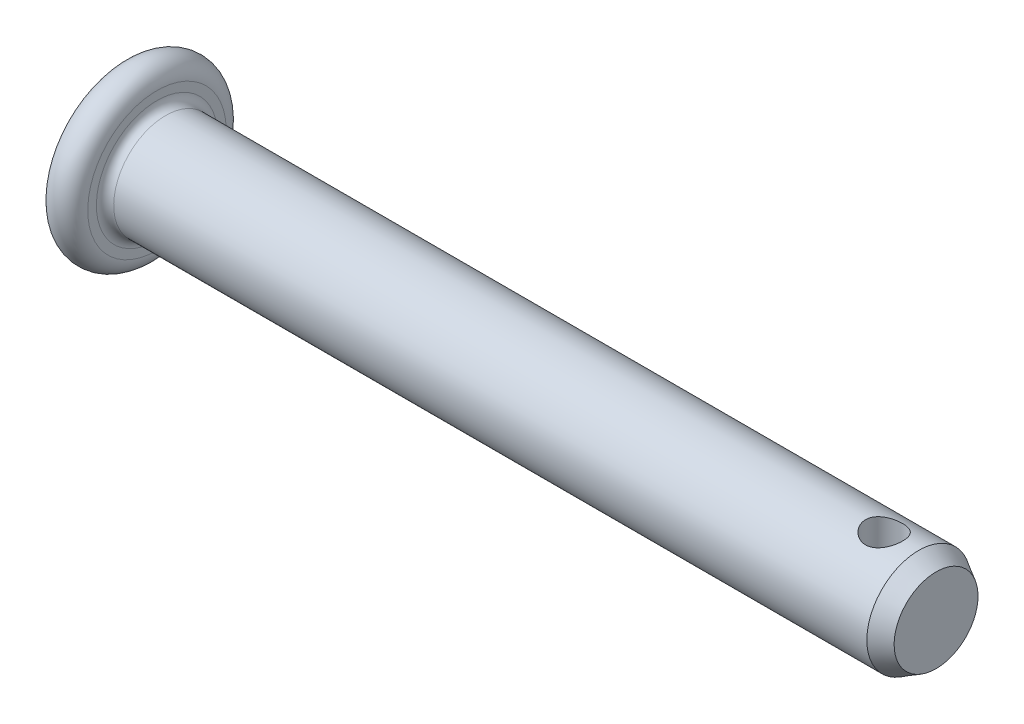
ISO-10303-21;
HEADER;
FILE_DESCRIPTION(('STEP AP214'),'2;1');
FILE_NAME('part.step','',(''),(''),'','','');
FILE_SCHEMA(('AUTOMOTIVE_DESIGN { 1 0 10303 214 1 1 1 1 }'));
ENDSEC;
DATA;
#1=APPLICATION_CONTEXT('core data for automotive mechanical design processes');
#2=APPLICATION_PROTOCOL_DEFINITION('international standard','automotive_design',2000,#1);
#3=PRODUCT_CONTEXT('',#1,'mechanical');
#4=PRODUCT('Part','Part','',(#3));
#5=PRODUCT_RELATED_PRODUCT_CATEGORY('part','',(#4));
#6=PRODUCT_DEFINITION_FORMATION('','',#4);
#7=PRODUCT_DEFINITION_CONTEXT('part definition',#1,'design');
#8=PRODUCT_DEFINITION('design','',#6,#7);
#9=PRODUCT_DEFINITION_SHAPE('','',#8);
#10=(LENGTH_UNIT() NAMED_UNIT(*) SI_UNIT(.MILLI.,.METRE.));
#11=(NAMED_UNIT(*) PLANE_ANGLE_UNIT() SI_UNIT($,.RADIAN.));
#12=(NAMED_UNIT(*) SI_UNIT($,.STERADIAN.) SOLID_ANGLE_UNIT());
#13=UNCERTAINTY_MEASURE_WITH_UNIT(LENGTH_MEASURE(1.E-05),#10,'distance_accuracy_value','');
#14=(GEOMETRIC_REPRESENTATION_CONTEXT(3) GLOBAL_UNCERTAINTY_ASSIGNED_CONTEXT((#13)) GLOBAL_UNIT_ASSIGNED_CONTEXT((#10,
#11,#12)) REPRESENTATION_CONTEXT('',''));
#15=CARTESIAN_POINT('',(0.,0.,0.));
#16=DIRECTION('',(0.,0.,1.));
#17=DIRECTION('',(1.,0.,0.));
#18=AXIS2_PLACEMENT_3D('',#15,#16,#17);
#19=CARTESIAN_POINT('',(47.,0.,0.));
#20=DIRECTION('',(-1.,0.,0.));
#21=DIRECTION('',(0.,-1.,0.));
#22=AXIS2_PLACEMENT_3D('',#19,#20,#21);
#23=PLANE('',#22);
#24=CARTESIAN_POINT('',(47.,0.,0.));
#25=DIRECTION('',(-1.,0.,0.));
#26=DIRECTION('',(0.,-1.,0.));
#27=AXIS2_PLACEMENT_3D('',#24,#25,#26);
#28=CIRCLE('',#27,2.42264973081038);
#29=CARTESIAN_POINT('',(47.,-2.42264973081038,0.));
#30=VERTEX_POINT('',#29);
#31=EDGE_CURVE('E107',#30,#30,#28,.T.);
#32=ORIENTED_EDGE('',*,*,#31,.F.);
#33=EDGE_LOOP('',(#32));
#34=FACE_BOUND('',#33,.T.);
#35=ADVANCED_FACE('F33',(#34),#23,.F.);
#36=CARTESIAN_POINT('',(0.,0.,0.));
#37=DIRECTION('',(1.,0.,0.));
#38=DIRECTION('',(0.,1.,0.));
#39=AXIS2_PLACEMENT_3D('',#36,#37,#38);
#40=PLANE('',#39);
#41=CARTESIAN_POINT('',(0.,0.,0.));
#42=DIRECTION('',(-1.,0.,0.));
#43=DIRECTION('',(0.,-1.,0.));
#44=AXIS2_PLACEMENT_3D('',#41,#42,#43);
#45=CIRCLE('',#44,4.);
#46=CARTESIAN_POINT('',(0.,-4.,0.));
#47=VERTEX_POINT('',#46);
#48=EDGE_CURVE('E51',#47,#47,#45,.T.);
#49=ORIENTED_EDGE('',*,*,#48,.T.);
#50=EDGE_LOOP('',(#49));
#51=FACE_BOUND('',#50,.T.);
#52=ADVANCED_FACE('F81',(#51),#40,.F.);
#53=CARTESIAN_POINT('',(1.,0.,0.));
#54=DIRECTION('',(-1.,0.,0.));
#55=DIRECTION('',(0.,-1.,0.));
#56=AXIS2_PLACEMENT_3D('',#53,#54,#55);
#57=TOROIDAL_SURFACE('',#56,4.,1.);
#58=ORIENTED_EDGE('',*,*,#48,.F.);
#59=EDGE_LOOP('',(#58));
#60=FACE_BOUND('',#59,.T.);
#61=CARTESIAN_POINT('',(2.,0.,0.));
#62=DIRECTION('',(-1.,0.,0.));
#63=DIRECTION('',(0.,-1.,0.));
#64=AXIS2_PLACEMENT_3D('',#61,#62,#63);
#65=CIRCLE('',#64,4.);
#66=CARTESIAN_POINT('',(2.,-4.,0.));
#67=VERTEX_POINT('',#66);
#68=EDGE_CURVE('E101',#67,#67,#65,.T.);
#69=ORIENTED_EDGE('',*,*,#68,.T.);
#70=EDGE_LOOP('',(#69));
#71=FACE_BOUND('',#70,.T.);
#72=ADVANCED_FACE('F86',(#60,#71),#57,.T.);
#73=CARTESIAN_POINT('',(2.,3.,0.));
#74=DIRECTION('',(-1.,0.,0.));
#75=DIRECTION('',(0.,-1.,0.));
#76=AXIS2_PLACEMENT_3D('',#73,#74,#75);
#77=PLANE('',#76);
#78=CARTESIAN_POINT('',(2.,0.,0.));
#79=DIRECTION('',(-1.,0.,0.));
#80=DIRECTION('',(0.,-1.,0.));
#81=AXIS2_PLACEMENT_3D('',#78,#79,#80);
#82=CIRCLE('',#81,3.5);
#83=CARTESIAN_POINT('',(2.,-3.5,0.));
#84=VERTEX_POINT('',#83);
#85=EDGE_CURVE('E46',#84,#84,#82,.T.);
#86=ORIENTED_EDGE('',*,*,#85,.T.);
#87=EDGE_LOOP('',(#86));
#88=FACE_BOUND('',#87,.T.);
#89=ORIENTED_EDGE('',*,*,#68,.F.);
#90=EDGE_LOOP('',(#89));
#91=FACE_BOUND('',#90,.T.);
#92=ADVANCED_FACE('F76',(#88,#91),#77,.F.);
#93=CARTESIAN_POINT('',(-19.830028721469,0.,0.));
#94=DIRECTION('',(-1.,0.,0.));
#95=DIRECTION('',(0.,-1.,0.));
#96=AXIS2_PLACEMENT_3D('',#93,#94,#95);
#97=CYLINDRICAL_SURFACE('',#96,3.);
#98=CARTESIAN_POINT('',(45.07,-3.,0.));
#99=CARTESIAN_POINT('',(45.0700011876972,-3.00000085236087,-0.0581444236668719));
#100=CARTESIAN_POINT('',(45.0652454821601,-2.99829449507259,-0.116280392908705));
#101=CARTESIAN_POINT('',(45.0464167005906,-2.99165685483232,-0.230825968284265));
#102=CARTESIAN_POINT('',(45.0323439537525,-2.98672568582106,-0.28723563533889));
#103=CARTESIAN_POINT('',(44.9954346036702,-2.97417071234846,-0.396660648282025));
#104=CARTESIAN_POINT('',(44.9726138998507,-2.9665517948651,-0.449681949737068));
#105=CARTESIAN_POINT('',(44.9189332388162,-2.94938858506761,-0.551142422044951));
#106=CARTESIAN_POINT('',(44.8880713620351,-2.93984383314657,-0.599580495033598));
#107=CARTESIAN_POINT('',(44.8179248823826,-2.9194071403264,-0.692387327079883));
#108=CARTESIAN_POINT('',(44.7783824473048,-2.90847964888086,-0.736553318241224));
#109=CARTESIAN_POINT('',(44.6925449030632,-2.88669310706967,-0.817786647986673));
#110=CARTESIAN_POINT('',(44.6462480088811,-2.87583407558994,-0.854852104086169));
#111=CARTESIAN_POINT('',(44.5463055685407,-2.85501068982919,-0.922060907926826));
#112=CARTESIAN_POINT('',(44.4924646657491,-2.84508892880968,-0.951928247953222));
#113=CARTESIAN_POINT('',(44.380113472799,-2.82781091224008,-1.00209513842957));
#114=CARTESIAN_POINT('',(44.3216048547123,-2.8204537430262,-1.02239809720235));
#115=CARTESIAN_POINT('',(44.2039019833382,-2.80951535958268,-1.0520772757923));
#116=CARTESIAN_POINT('',(44.1448172357284,-2.80580193327061,-1.06183749683206));
#117=CARTESIAN_POINT('',(44.0257409145972,-2.8021825601748,-1.07135492754196));
#118=CARTESIAN_POINT('',(43.9657496791047,-2.80227522749661,-1.0711157782338));
#119=CARTESIAN_POINT('',(43.8499646708127,-2.80614272311333,-1.06093690056902));
#120=CARTESIAN_POINT('',(43.7941176270585,-2.80972098646963,-1.05151500443465));
#121=CARTESIAN_POINT('',(43.684856523547,-2.81983209908789,-1.02408901959715));
#122=CARTESIAN_POINT('',(43.631442796367,-2.82636535090163,-1.00608376158292));
#123=CARTESIAN_POINT('',(43.5274547890558,-2.84177828691616,-0.961693602686381));
#124=CARTESIAN_POINT('',(43.4769475973174,-2.85069749916812,-0.935165865592745));
#125=CARTESIAN_POINT('',(43.3809452449066,-2.86986267945419,-0.874583078748186));
#126=CARTESIAN_POINT('',(43.3354516997628,-2.8801090728408,-0.840525613286241));
#127=CARTESIAN_POINT('',(43.2478812607032,-2.90152902086688,-0.763427644942957));
#128=CARTESIAN_POINT('',(43.206176106455,-2.91272121621961,-0.719969138346395));
#129=CARTESIAN_POINT('',(43.1305412101273,-2.93423605096064,-0.626541431645342));
#130=CARTESIAN_POINT('',(43.096612445826,-2.94455858089692,-0.576571414042076));
#131=CARTESIAN_POINT('',(43.037134911732,-2.96334280106686,-0.470663813489915));
#132=CARTESIAN_POINT('',(43.0116989156008,-2.97177899260399,-0.41465805771301));
#133=CARTESIAN_POINT('',(42.9707295339136,-2.98565291760969,-0.298787834826479));
#134=CARTESIAN_POINT('',(42.9551921867146,-2.99109185052508,-0.238924922006458));
#135=CARTESIAN_POINT('',(42.9351502569951,-2.99815307150106,-0.120176713024237));
#136=CARTESIAN_POINT('',(42.9301443365055,-2.99994863872938,-0.0613862385932611));
#137=CARTESIAN_POINT('',(42.9298619122213,-3.0000491325843,0.0562146696396688));
#138=CARTESIAN_POINT('',(42.9345834909011,-2.99835474716508,0.115025097223483));
#139=CARTESIAN_POINT('',(42.9532334090568,-2.99178024275448,0.228902798115541));
#140=CARTESIAN_POINT('',(42.966842749204,-2.9870105745618,0.284029339909902));
#141=CARTESIAN_POINT('',(43.0024714986183,-2.97487542105585,0.391185719351828));
#142=CARTESIAN_POINT('',(43.0244919996437,-2.96750959877458,0.443215153984975));
#143=CARTESIAN_POINT('',(43.0769982314489,-2.95066063760259,0.544338996176854));
#144=CARTESIAN_POINT('',(43.107704982926,-2.94112369208754,0.593309412151399));
#145=CARTESIAN_POINT('',(43.1764581116928,-2.92100017959612,0.685558726346786));
#146=CARTESIAN_POINT('',(43.2145070016372,-2.91041325389611,0.72883566757353));
#147=CARTESIAN_POINT('',(43.2992134462063,-2.88867484913537,0.810833788817092));
#148=CARTESIAN_POINT('',(43.3462173600148,-2.87752282581952,0.849197933366988));
#149=CARTESIAN_POINT('',(43.4462261994023,-2.85646292212537,0.917552598759176));
#150=CARTESIAN_POINT('',(43.4992314120457,-2.84655510130972,0.947542718802958));
#151=CARTESIAN_POINT('',(43.6099668619782,-2.8291763691011,0.998240487223736));
#152=CARTESIAN_POINT('',(43.6677017385475,-2.82170788711416,1.01893888935077));
#153=CARTESIAN_POINT('',(43.7861729264571,-2.81022365284711,1.05020274987965));
#154=CARTESIAN_POINT('',(43.8469075987407,-2.80620603664474,1.06077367880805));
#155=CARTESIAN_POINT('',(43.9658279695292,-2.80231029733869,1.07102011644591));
#156=CARTESIAN_POINT('',(44.0239548678002,-2.80220371006762,1.07129697066714));
#157=CARTESIAN_POINT('',(44.1393796330133,-2.80556573590001,1.0624607102674));
#158=CARTESIAN_POINT('',(44.1966775637668,-2.80903407231596,1.05334832234342));
#159=CARTESIAN_POINT('',(44.3073786660326,-2.81897366332907,1.02644235659171));
#160=CARTESIAN_POINT('',(44.3608433391118,-2.82536785008475,1.00887100662083));
#161=CARTESIAN_POINT('',(44.4641022604647,-2.84040087461525,0.96573395605646));
#162=CARTESIAN_POINT('',(44.5138956232391,-2.84904025165859,0.94016633455127));
#163=CARTESIAN_POINT('',(44.6110273518143,-2.86811343709818,0.880315920251174));
#164=CARTESIAN_POINT('',(44.658128580184,-2.8786140770729,0.845669776577044));
#165=CARTESIAN_POINT('',(44.7460418476776,-2.89997524804009,0.769231276304803));
#166=CARTESIAN_POINT('',(44.7868519805052,-2.91083588691111,0.727436761704251));
#167=CARTESIAN_POINT('',(44.8629720193145,-2.93230677789537,0.635533564492521));
#168=CARTESIAN_POINT('',(44.8979330046734,-2.94288123522134,0.585126317810479));
#169=CARTESIAN_POINT('',(44.9588615768249,-2.96203926538264,0.478788097154092));
#170=CARTESIAN_POINT('',(44.9848298787494,-2.97062299651003,0.422857562867087));
#171=CARTESIAN_POINT('',(45.0269245871362,-2.98484138608738,0.306830038272942));
#172=CARTESIAN_POINT('',(45.0430193844933,-2.99046656489376,0.246720345464761));
#173=CARTESIAN_POINT('',(45.0645543914337,-2.99804470450523,0.124403328906361));
#174=CARTESIAN_POINT('',(45.0699987295257,-2.99999908823344,0.0621968274718898));
#175=CARTESIAN_POINT('',(45.07,-3.,0.));
#176=B_SPLINE_CURVE_WITH_KNOTS('',3,(#98,#99,#100,#101,#102,#103,#104,#105,#106,#107,#108,#109,
#110,#111,#112,#113,#114,#115,#116,#117,#118,#119,#120,#121,#122,#123,#124,#125,#126,#127,#128,
#129,#130,#131,#132,#133,#134,#135,#136,#137,#138,#139,#140,#141,#142,#143,#144,#145,#146,#147,
#148,#149,#150,#151,#152,#153,#154,#155,#156,#157,#158,#159,#160,#161,#162,#163,#164,#165,#166,
#167,#168,#169,#170,#171,#172,#173,#174,#175),.UNSPECIFIED.,.T.,.F.,(4,2,2,2,2,2,2,2,2,2,2,2,2,
2,2,2,2,2,2,2,2,2,2,2,2,2,2,2,2,2,2,2,2,2,2,2,2,2,4),(0.,0.174204089504534,0.348402024271801,
0.522284843760434,0.696209210160765,0.876244346087946,1.05632714683901,1.24249092709145,
1.42858831652132,1.60765161756263,1.78664971772964,1.95610515861389,2.12558369100691,
2.29806543907981,2.47060260379345,2.65354951370591,2.83651941416981,3.02183035684228,
3.20706708759125,3.38326542768573,3.55942903814504,3.72959363217553,3.89978032086954,
4.07476186396814,4.24980339646158,4.43400719613059,4.61821981067209,4.80261533224673,
4.9869111931974,5.16042307890219,5.3339215363568,5.503091972927,5.67230307987681,
5.84974282452736,6.02723623083897,6.21307677666722,6.39890254036339,6.58532014499977,
6.77166547300385),.UNSPECIFIED.);
#177=CARTESIAN_POINT('',(45.07,-3.,0.));
#178=VERTEX_POINT('',#177);
#179=EDGE_CURVE('E37',#178,#178,#176,.T.);
#180=ORIENTED_EDGE('',*,*,#179,.T.);
#181=EDGE_LOOP('',(#180));
#182=FACE_BOUND('',#181,.T.);
#183=CARTESIAN_POINT('',(44.,2.80269513147613,1.07));
#184=CARTESIAN_POINT('',(43.9419887063329,2.80269405453403,1.0700012325407));
#185=CARTESIAN_POINT('',(43.8839859386846,2.80451586869679,1.06526645252533));
#186=CARTESIAN_POINT('',(43.7697155758882,2.81156129057399,1.04652836683259));
#187=CARTESIAN_POINT('',(43.713448070444,2.81678507384476,1.03252458283389));
#188=CARTESIAN_POINT('',(43.6043259729849,2.82996906177154,0.995816550026891));
#189=CARTESIAN_POINT('',(43.5514641874673,2.83792325812027,0.973131392204395));
#190=CARTESIAN_POINT('',(43.4502774278851,2.85566258920245,0.91977119339298));
#191=CARTESIAN_POINT('',(43.4019536704409,2.86544821283892,0.889094018060433));
#192=CARTESIAN_POINT('',(43.3090459972175,2.88624009166458,0.819145873119074));
#193=CARTESIAN_POINT('',(43.2646949699833,2.89727985145855,0.779575453093879));
#194=CARTESIAN_POINT('',(43.1830966677931,2.91905497372718,0.693601114916201));
#195=CARTESIAN_POINT('',(43.1458507295916,2.92979027859875,0.647195913769573));
#196=CARTESIAN_POINT('',(43.0784278603396,2.9501404572588,0.547130932879753));
#197=CARTESIAN_POINT('',(43.0484999324569,2.95971140880334,0.493293649872756));
#198=CARTESIAN_POINT('',(42.9982202526059,2.97625540699158,0.380947716416214));
#199=CARTESIAN_POINT('',(42.9778655186336,2.98322926247711,0.322440527271211));
#200=CARTESIAN_POINT('',(42.9481144792529,2.99355571699264,0.204861066126766));
#201=CARTESIAN_POINT('',(42.9383181349319,2.9970401264487,0.145901813302197));
#202=CARTESIAN_POINT('',(42.9286846223207,3.00046579172429,0.027080162146312));
#203=CARTESIAN_POINT('',(42.9288445223152,3.00040809055365,-0.0327819651339629));
#204=CARTESIAN_POINT('',(42.9388765441916,2.99684237892632,-0.148859102673279));
#205=CARTESIAN_POINT('',(42.9483130279595,2.99348913261421,-0.205117321064766));
#206=CARTESIAN_POINT('',(42.9759031818784,2.98390815583305,-0.315191872236678));
#207=CARTESIAN_POINT('',(42.9940574604262,2.97768022474686,-0.36900803430409));
#208=CARTESIAN_POINT('',(43.0387932090632,2.96286490572021,-0.473561943092384));
#209=CARTESIAN_POINT('',(43.065489159384,2.95424569011256,-0.524246010565809));
#210=CARTESIAN_POINT('',(43.1264525324705,2.93553145734555,-0.620535696002865));
#211=CARTESIAN_POINT('',(43.160722258636,2.92543599153339,-0.666139762634615));
#212=CARTESIAN_POINT('',(43.2380038453613,2.90418445697619,-0.753554237358309));
#213=CARTESIAN_POINT('',(43.281384783137,2.89300053975554,-0.795032073482364));
#214=CARTESIAN_POINT('',(43.3745676367302,2.87127425409409,-0.870241508433982));
#215=CARTESIAN_POINT('',(43.4243708601758,2.86073201694968,-0.903971525843671));
#216=CARTESIAN_POINT('',(43.5301782703851,2.84131733682197,-0.963281437747517));
#217=CARTESIAN_POINT('',(43.5862796479569,2.83247916578311,-0.988700048233417));
#218=CARTESIAN_POINT('',(43.7023634377384,2.81786849291985,-1.0296089827854));
#219=CARTESIAN_POINT('',(43.7623439199072,2.81209447949582,-1.04510420300563));
#220=CARTESIAN_POINT('',(43.8812241841887,2.80461577891204,-1.06500624370513));
#221=CARTESIAN_POINT('',(43.9400243448385,2.80271945624832,-1.06993586022511));
#222=CARTESIAN_POINT('',(44.0576295621054,2.80267129757252,-1.07006285392986));
#223=CARTESIAN_POINT('',(44.1164346148852,2.80451864836444,-1.06526234468011));
#224=CARTESIAN_POINT('',(44.2298406281345,2.81155662180325,-1.04653762268764));
#225=CARTESIAN_POINT('',(44.2845149112387,2.81660599926511,-1.03299845351078));
#226=CARTESIAN_POINT('',(44.390797458923,2.82931702532797,-0.997654939685915));
#227=CARTESIAN_POINT('',(44.4424051301972,2.83697917750988,-0.975849001626951));
#228=CARTESIAN_POINT('',(44.5430961915697,2.85438354951197,-0.9237275285171));
#229=CARTESIAN_POINT('',(44.5920278822408,2.86418921830273,-0.893140721738192));
#230=CARTESIAN_POINT('',(44.6842514327376,2.88466187449566,-0.824622682092637));
#231=CARTESIAN_POINT('',(44.7275413965204,2.89532914952116,-0.78668899071603));
#232=CARTESIAN_POINT('',(44.8097787176061,2.91704972348052,-0.70202091047889));
#233=CARTESIAN_POINT('',(44.8483439901029,2.9280909099623,-0.65491109361135));
#234=CARTESIAN_POINT('',(44.9170580182629,2.94873172232067,-0.554615982941776));
#235=CARTESIAN_POINT('',(44.9472069184723,2.95833137295346,-0.501430793502751));
#236=CARTESIAN_POINT('',(44.9979907902605,2.97498086653635,-0.390648793902493));
#237=CARTESIAN_POINT('',(45.0186741109116,2.98204362685798,-0.333076196099868));
#238=CARTESIAN_POINT('',(45.04996136586,2.99287501183841,-0.214963279950154));
#239=CARTESIAN_POINT('',(45.0605695320171,2.99664501949614,-0.154424218850739));
#240=CARTESIAN_POINT('',(45.0709823447268,3.00034699208308,-0.0355680943413805));
#241=CARTESIAN_POINT('',(45.0713321682795,3.00047263193113,0.0226956413885337));
#242=CARTESIAN_POINT('',(45.0625946649115,2.99736395549749,0.138413857875145));
#243=CARTESIAN_POINT('',(45.0535082992324,2.99412998145154,0.19586842045612));
#244=CARTESIAN_POINT('',(45.0265311891147,2.98474651147728,0.307159445380952));
#245=CARTESIAN_POINT('',(45.0088233654925,2.97865768197409,0.361045741280804));
#246=CARTESIAN_POINT('',(44.9652818790851,2.96419445462514,0.4650949755321));
#247=CARTESIAN_POINT('',(44.9394466943722,2.95581962874319,0.515257214341269));
#248=CARTESIAN_POINT('',(44.8792017971977,2.93721704081465,0.612626965016573));
#249=CARTESIAN_POINT('',(44.8444904984025,2.92692857167363,0.659636090831002));
#250=CARTESIAN_POINT('',(44.7679706000017,2.90577498628147,0.747335553361889));
#251=CARTESIAN_POINT('',(44.7261595778756,2.89490967407648,0.788023724179238));
#252=CARTESIAN_POINT('',(44.6343075816394,2.87321542156461,0.86386498597922));
#253=CARTESIAN_POINT('',(44.5839741575494,2.86241170542807,0.898672367484211));
#254=CARTESIAN_POINT('',(44.4778301251637,2.84265870027642,0.959329695321699));
#255=CARTESIAN_POINT('',(44.4220199099601,2.83370927831408,0.985180283918352));
#256=CARTESIAN_POINT('',(44.3062385239419,2.81879108512833,1.02709198290546));
#257=CARTESIAN_POINT('',(44.2462549471952,2.81283167439824,1.043122384521));
#258=CARTESIAN_POINT('',(44.1241769470664,2.80478523843407,1.06457309057968));
#259=CARTESIAN_POINT('',(44.062083591004,2.8026962840178,1.06999868093697));
#260=CARTESIAN_POINT('',(44.,2.80269513147613,1.07));
#261=B_SPLINE_CURVE_WITH_KNOTS('',3,(#183,#184,#185,#186,#187,#188,#189,#190,#191,#192,#193,
#194,#195,#196,#197,#198,#199,#200,#201,#202,#203,#204,#205,#206,#207,#208,#209,#210,#211,#212,
#213,#214,#215,#216,#217,#218,#219,#220,#221,#222,#223,#224,#225,#226,#227,#228,#229,#230,#231,
#232,#233,#234,#235,#236,#237,#238,#239,#240,#241,#242,#243,#244,#245,#246,#247,#248,#249,#250,
#251,#252,#253,#254,#255,#256,#257,#258,#259,#260),.UNSPECIFIED.,.T.,.F.,(4,2,2,2,2,2,2,2,2,2,2,
2,2,2,2,2,2,2,2,2,2,2,2,2,2,2,2,2,2,2,2,2,2,2,2,2,2,2,4),(0.,0.17380327215547,0.347615514022829,
0.521047706090481,0.69452626242438,0.875079612774971,1.05566689908119,1.24173792683391,
1.42775095590531,1.60643756309914,1.7850715544909,1.95569889276221,2.12633814049469,
2.2993675829719,2.4724497211967,2.65477340417337,2.83713426848319,3.02284867184578,
3.20847137385512,3.38467433504895,3.56083902576241,3.72972725558063,3.89864805499095,
4.0734846652866,4.24837988308281,4.43312891642298,4.61787477661352,4.80166614498411,
4.98538028141735,5.15931221552376,5.33322643334242,5.50360170838114,5.67400890686077,
5.85123086199186,6.02851340958723,6.21404625791441,6.39956579949527,6.58566255796007,
6.771666533765),.UNSPECIFIED.);
#262=CARTESIAN_POINT('',(44.,2.80269513147613,1.07));
#263=VERTEX_POINT('',#262);
#264=EDGE_CURVE('E54',#263,#263,#261,.T.);
#265=ORIENTED_EDGE('',*,*,#264,.T.);
#266=EDGE_LOOP('',(#265));
#267=FACE_BOUND('',#266,.T.);
#268=CARTESIAN_POINT('',(2.5,0.,0.));
#269=DIRECTION('',(-1.,0.,0.));
#270=DIRECTION('',(0.,-1.,0.));
#271=AXIS2_PLACEMENT_3D('',#268,#269,#270);
#272=CIRCLE('',#271,3.);
#273=CARTESIAN_POINT('',(2.5,-3.,0.));
#274=VERTEX_POINT('',#273);
#275=EDGE_CURVE('E10',#274,#274,#272,.F.);
#276=ORIENTED_EDGE('',*,*,#275,.T.);
#277=EDGE_LOOP('',(#276));
#278=FACE_BOUND('',#277,.T.);
#279=CARTESIAN_POINT('',(46.,0.,0.));
#280=DIRECTION('',(-1.,0.,0.));
#281=DIRECTION('',(0.,-1.,0.));
#282=AXIS2_PLACEMENT_3D('',#279,#280,#281);
#283=CIRCLE('',#282,3.00000000000001);
#284=CARTESIAN_POINT('',(46.,-3.00000000000001,0.));
#285=VERTEX_POINT('',#284);
#286=EDGE_CURVE('E103',#285,#285,#283,.T.);
#287=ORIENTED_EDGE('',*,*,#286,.T.);
#288=EDGE_LOOP('',(#287));
#289=FACE_BOUND('',#288,.T.);
#290=ADVANCED_FACE('F59',(#182,#267,#278,#289),#97,.T.);
#291=CARTESIAN_POINT('',(47.,0.,0.));
#292=DIRECTION('',(-1.,0.,0.));
#293=DIRECTION('',(0.,-1.,0.));
#294=AXIS2_PLACEMENT_3D('',#291,#292,#293);
#295=CONICAL_SURFACE('',#294,2.42264973081038,0.5235987755983);
#296=ORIENTED_EDGE('',*,*,#286,.F.);
#297=EDGE_LOOP('',(#296));
#298=FACE_BOUND('',#297,.T.);
#299=ORIENTED_EDGE('',*,*,#31,.T.);
#300=EDGE_LOOP('',(#299));
#301=FACE_BOUND('',#300,.T.);
#302=ADVANCED_FACE('F67',(#298,#301),#295,.T.);
#303=CARTESIAN_POINT('',(2.5,0.,0.));
#304=DIRECTION('',(-1.,0.,0.));
#305=DIRECTION('',(0.,-1.,0.));
#306=AXIS2_PLACEMENT_3D('',#303,#304,#305);
#307=TOROIDAL_SURFACE('',#306,3.5,0.5);
#308=ORIENTED_EDGE('',*,*,#275,.F.);
#309=EDGE_LOOP('',(#308));
#310=FACE_BOUND('',#309,.T.);
#311=ORIENTED_EDGE('',*,*,#85,.F.);
#312=EDGE_LOOP('',(#311));
#313=FACE_BOUND('',#312,.T.);
#314=ADVANCED_FACE('F35',(#310,#313),#307,.F.);
#315=CARTESIAN_POINT('',(44.,-5.,0.));
#316=DIRECTION('',(0.,1.,0.));
#317=DIRECTION('',(0.,0.,1.));
#318=AXIS2_PLACEMENT_3D('',#315,#316,#317);
#319=CYLINDRICAL_SURFACE('',#318,1.07);
#320=ORIENTED_EDGE('',*,*,#264,.F.);
#321=EDGE_LOOP('',(#320));
#322=FACE_BOUND('',#321,.T.);
#323=ORIENTED_EDGE('',*,*,#179,.F.);
#324=EDGE_LOOP('',(#323));
#325=FACE_BOUND('',#324,.T.);
#326=ADVANCED_FACE('F63',(#322,#325),#319,.F.);
#327=CLOSED_SHELL('',(#35,#52,#72,#92,#290,#302,#314,#326));
#328=MANIFOLD_SOLID_BREP('B2',#327);
#329=ADVANCED_BREP_SHAPE_REPRESENTATION('',(#18,#328),#14);
#330=SHAPE_DEFINITION_REPRESENTATION(#9,#329);
ENDSEC;
END-ISO-10303-21;
